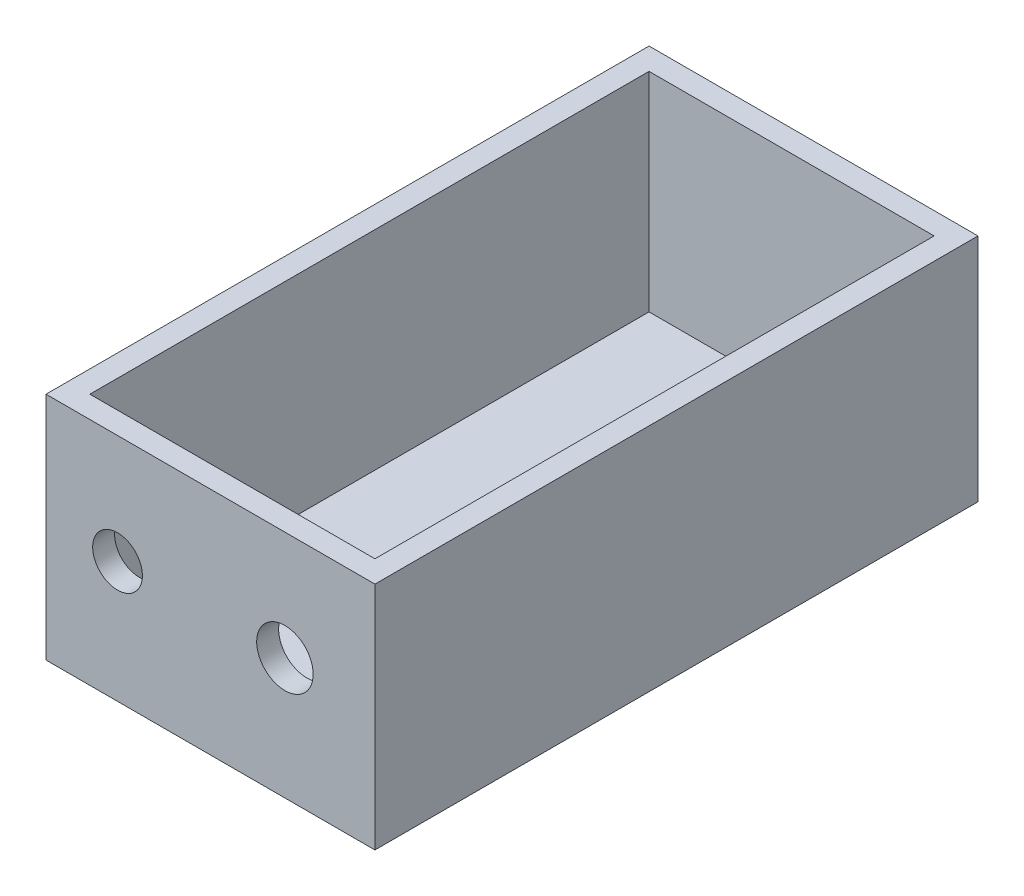
ISO-10303-21;
HEADER;
FILE_DESCRIPTION(('STEP AP214'),'2;1');
FILE_NAME('part.step','',(''),(''),'','','');
FILE_SCHEMA(('AUTOMOTIVE_DESIGN { 1 0 10303 214 1 1 1 1 }'));
ENDSEC;
DATA;
#1=APPLICATION_CONTEXT('core data for automotive mechanical design processes');
#2=APPLICATION_PROTOCOL_DEFINITION('international standard','automotive_design',2000,#1);
#3=PRODUCT_CONTEXT('',#1,'mechanical');
#4=PRODUCT('Part','Part','',(#3));
#5=PRODUCT_RELATED_PRODUCT_CATEGORY('part','',(#4));
#6=PRODUCT_DEFINITION_FORMATION('','',#4);
#7=PRODUCT_DEFINITION_CONTEXT('part definition',#1,'design');
#8=PRODUCT_DEFINITION('design','',#6,#7);
#9=PRODUCT_DEFINITION_SHAPE('','',#8);
#10=(LENGTH_UNIT() NAMED_UNIT(*) SI_UNIT(.MILLI.,.METRE.));
#11=(NAMED_UNIT(*) PLANE_ANGLE_UNIT() SI_UNIT($,.RADIAN.));
#12=(NAMED_UNIT(*) SI_UNIT($,.STERADIAN.) SOLID_ANGLE_UNIT());
#13=UNCERTAINTY_MEASURE_WITH_UNIT(LENGTH_MEASURE(1.E-05),#10,'distance_accuracy_value','');
#14=(GEOMETRIC_REPRESENTATION_CONTEXT(3) GLOBAL_UNCERTAINTY_ASSIGNED_CONTEXT((#13)) GLOBAL_UNIT_ASSIGNED_CONTEXT((#10,
#11,#12)) REPRESENTATION_CONTEXT('',''));
#15=CARTESIAN_POINT('',(0.,0.,0.));
#16=DIRECTION('',(0.,0.,1.));
#17=DIRECTION('',(1.,0.,0.));
#18=AXIS2_PLACEMENT_3D('',#15,#16,#17);
#19=CARTESIAN_POINT('',(0.,21.,0.));
#20=DIRECTION('',(1.,0.,0.));
#21=DIRECTION('',(0.,0.,-1.));
#22=AXIS2_PLACEMENT_3D('',#19,#20,#21);
#23=PLANE('',#22);
#24=DIRECTION('',(0.,0.,1.));
#25=VECTOR('',#24,1.);
#26=CARTESIAN_POINT('',(0.,0.,0.));
#27=LINE('',#26,#25);
#28=CARTESIAN_POINT('',(0.,0.,-55.));
#29=VERTEX_POINT('',#28);
#30=CARTESIAN_POINT('',(0.,0.,0.));
#31=VERTEX_POINT('',#30);
#32=EDGE_CURVE('E163',#29,#31,#27,.T.);
#33=ORIENTED_EDGE('',*,*,#32,.T.);
#34=DIRECTION('',(0.,-1.,0.));
#35=VECTOR('',#34,1.);
#36=CARTESIAN_POINT('',(0.,21.,0.));
#37=LINE('',#36,#35);
#38=CARTESIAN_POINT('',(0.,21.,0.));
#39=VERTEX_POINT('',#38);
#40=EDGE_CURVE('E11',#39,#31,#37,.T.);
#41=ORIENTED_EDGE('',*,*,#40,.F.);
#42=DIRECTION('',(0.,0.,1.));
#43=VECTOR('',#42,1.);
#44=CARTESIAN_POINT('',(0.,21.,0.));
#45=LINE('',#44,#43);
#46=CARTESIAN_POINT('',(0.,21.,-55.));
#47=VERTEX_POINT('',#46);
#48=EDGE_CURVE('E169',#47,#39,#45,.T.);
#49=ORIENTED_EDGE('',*,*,#48,.F.);
#50=DIRECTION('',(0.,-1.,0.));
#51=VECTOR('',#50,1.);
#52=CARTESIAN_POINT('',(0.,21.,-55.));
#53=LINE('',#52,#51);
#54=EDGE_CURVE('E179',#47,#29,#53,.T.);
#55=ORIENTED_EDGE('',*,*,#54,.T.);
#56=EDGE_LOOP('',(#33,#41,#49,#55));
#57=FACE_BOUND('',#56,.T.);
#58=ADVANCED_FACE('F39',(#57),#23,.F.);
#59=CARTESIAN_POINT('',(0.,21.,0.));
#60=DIRECTION('',(0.,0.,-1.));
#61=DIRECTION('',(-1.,0.,0.));
#62=AXIS2_PLACEMENT_3D('',#59,#60,#61);
#63=PLANE('',#62);
#64=CARTESIAN_POINT('',(6.52409258425673,11.0547059827059,0.));
#65=DIRECTION('',(0.,0.,1.));
#66=DIRECTION('',(1.,0.,0.));
#67=AXIS2_PLACEMENT_3D('',#64,#65,#66);
#68=CIRCLE('',#67,2.26711259975675);
#69=CARTESIAN_POINT('',(8.79120518401348,11.0547059827059,0.));
#70=VERTEX_POINT('',#69);
#71=EDGE_CURVE('E201',#70,#70,#68,.T.);
#72=ORIENTED_EDGE('',*,*,#71,.F.);
#73=EDGE_LOOP('',(#72));
#74=FACE_BOUND('',#73,.T.);
#75=CARTESIAN_POINT('',(21.7896012283179,11.0547059827059,0.));
#76=DIRECTION('',(0.,0.,1.));
#77=DIRECTION('',(1.,0.,0.));
#78=AXIS2_PLACEMENT_3D('',#75,#76,#77);
#79=CIRCLE('',#78,2.5738357597545);
#80=CARTESIAN_POINT('',(24.3634369880724,11.0547059827059,0.));
#81=VERTEX_POINT('',#80);
#82=EDGE_CURVE('E145',#81,#81,#79,.T.);
#83=ORIENTED_EDGE('',*,*,#82,.F.);
#84=EDGE_LOOP('',(#83));
#85=FACE_BOUND('',#84,.T.);
#86=DIRECTION('',(1.,0.,0.));
#87=VECTOR('',#86,1.);
#88=CARTESIAN_POINT('',(0.,0.,0.));
#89=LINE('',#88,#87);
#90=CARTESIAN_POINT('',(30.,0.,0.));
#91=VERTEX_POINT('',#90);
#92=EDGE_CURVE('E183',#31,#91,#89,.T.);
#93=ORIENTED_EDGE('',*,*,#92,.T.);
#94=DIRECTION('',(0.,-1.,0.));
#95=VECTOR('',#94,1.);
#96=CARTESIAN_POINT('',(30.,21.,0.));
#97=LINE('',#96,#95);
#98=CARTESIAN_POINT('',(30.,21.,0.));
#99=VERTEX_POINT('',#98);
#100=EDGE_CURVE('E48',#99,#91,#97,.T.);
#101=ORIENTED_EDGE('',*,*,#100,.F.);
#102=DIRECTION('',(1.,0.,0.));
#103=VECTOR('',#102,1.);
#104=CARTESIAN_POINT('',(0.,21.,0.));
#105=LINE('',#104,#103);
#106=EDGE_CURVE('E93',#39,#99,#105,.T.);
#107=ORIENTED_EDGE('',*,*,#106,.F.);
#108=ORIENTED_EDGE('',*,*,#40,.T.);
#109=EDGE_LOOP('',(#93,#101,#107,#108));
#110=FACE_BOUND('',#109,.T.);
#111=ADVANCED_FACE('F217',(#74,#85,#110),#63,.F.);
#112=CARTESIAN_POINT('',(30.,21.,0.));
#113=DIRECTION('',(-1.,0.,0.));
#114=DIRECTION('',(0.,0.,1.));
#115=AXIS2_PLACEMENT_3D('',#112,#113,#114);
#116=PLANE('',#115);
#117=DIRECTION('',(0.,0.,-1.));
#118=VECTOR('',#117,1.);
#119=CARTESIAN_POINT('',(30.,0.,0.));
#120=LINE('',#119,#118);
#121=CARTESIAN_POINT('',(30.,0.,-55.));
#122=VERTEX_POINT('',#121);
#123=EDGE_CURVE('E186',#91,#122,#120,.T.);
#124=ORIENTED_EDGE('',*,*,#123,.T.);
#125=DIRECTION('',(0.,-1.,0.));
#126=VECTOR('',#125,1.);
#127=CARTESIAN_POINT('',(30.,21.,-55.));
#128=LINE('',#127,#126);
#129=CARTESIAN_POINT('',(30.,21.,-55.));
#130=VERTEX_POINT('',#129);
#131=EDGE_CURVE('E193',#130,#122,#128,.T.);
#132=ORIENTED_EDGE('',*,*,#131,.F.);
#133=DIRECTION('',(0.,0.,-1.));
#134=VECTOR('',#133,1.);
#135=CARTESIAN_POINT('',(30.,21.,0.));
#136=LINE('',#135,#134);
#137=EDGE_CURVE('E174',#99,#130,#136,.T.);
#138=ORIENTED_EDGE('',*,*,#137,.F.);
#139=ORIENTED_EDGE('',*,*,#100,.T.);
#140=EDGE_LOOP('',(#124,#132,#138,#139));
#141=FACE_BOUND('',#140,.T.);
#142=ADVANCED_FACE('F219',(#141),#116,.F.);
#143=CARTESIAN_POINT('',(0.,21.,-55.));
#144=DIRECTION('',(0.,0.,1.));
#145=DIRECTION('',(1.,0.,0.));
#146=AXIS2_PLACEMENT_3D('',#143,#144,#145);
#147=PLANE('',#146);
#148=DIRECTION('',(-1.,0.,0.));
#149=VECTOR('',#148,1.);
#150=CARTESIAN_POINT('',(0.,0.,-55.));
#151=LINE('',#150,#149);
#152=EDGE_CURVE('E86',#122,#29,#151,.T.);
#153=ORIENTED_EDGE('',*,*,#152,.T.);
#154=ORIENTED_EDGE('',*,*,#54,.F.);
#155=DIRECTION('',(-1.,0.,0.));
#156=VECTOR('',#155,1.);
#157=CARTESIAN_POINT('',(0.,21.,-55.));
#158=LINE('',#157,#156);
#159=EDGE_CURVE('E65',#130,#47,#158,.T.);
#160=ORIENTED_EDGE('',*,*,#159,.F.);
#161=ORIENTED_EDGE('',*,*,#131,.T.);
#162=EDGE_LOOP('',(#153,#154,#160,#161));
#163=FACE_BOUND('',#162,.T.);
#164=ADVANCED_FACE('F231',(#163),#147,.F.);
#165=CARTESIAN_POINT('',(0.,21.,0.));
#166=DIRECTION('',(0.,-1.,0.));
#167=DIRECTION('',(0.,0.,-1.));
#168=AXIS2_PLACEMENT_3D('',#165,#166,#167);
#169=PLANE('',#168);
#170=DIRECTION('',(1.,0.,0.));
#171=VECTOR('',#170,1.);
#172=CARTESIAN_POINT('',(2.,21.,-2.));
#173=LINE('',#172,#171);
#174=CARTESIAN_POINT('',(2.,21.,-2.));
#175=VERTEX_POINT('',#174);
#176=CARTESIAN_POINT('',(28.,21.,-2.));
#177=VERTEX_POINT('',#176);
#178=EDGE_CURVE('E154',#175,#177,#173,.T.);
#179=ORIENTED_EDGE('',*,*,#178,.F.);
#180=DIRECTION('',(0.,0.,1.));
#181=VECTOR('',#180,1.);
#182=CARTESIAN_POINT('',(2.,21.,-53.));
#183=LINE('',#182,#181);
#184=CARTESIAN_POINT('',(2.,21.,-53.));
#185=VERTEX_POINT('',#184);
#186=EDGE_CURVE('E56',#185,#175,#183,.T.);
#187=ORIENTED_EDGE('',*,*,#186,.F.);
#188=DIRECTION('',(-1.,0.,0.));
#189=VECTOR('',#188,1.);
#190=CARTESIAN_POINT('',(28.,21.,-53.));
#191=LINE('',#190,#189);
#192=CARTESIAN_POINT('',(28.,21.,-53.));
#193=VERTEX_POINT('',#192);
#194=EDGE_CURVE('E138',#193,#185,#191,.T.);
#195=ORIENTED_EDGE('',*,*,#194,.F.);
#196=DIRECTION('',(0.,0.,-1.));
#197=VECTOR('',#196,1.);
#198=CARTESIAN_POINT('',(28.,21.,-2.));
#199=LINE('',#198,#197);
#200=EDGE_CURVE('E142',#177,#193,#199,.T.);
#201=ORIENTED_EDGE('',*,*,#200,.F.);
#202=EDGE_LOOP('',(#179,#187,#195,#201));
#203=FACE_BOUND('',#202,.T.);
#204=ORIENTED_EDGE('',*,*,#48,.T.);
#205=ORIENTED_EDGE('',*,*,#106,.T.);
#206=ORIENTED_EDGE('',*,*,#137,.T.);
#207=ORIENTED_EDGE('',*,*,#159,.T.);
#208=EDGE_LOOP('',(#204,#205,#206,#207));
#209=FACE_BOUND('',#208,.T.);
#210=ADVANCED_FACE('F233',(#203,#209),#169,.F.);
#211=CARTESIAN_POINT('',(0.,0.,0.));
#212=DIRECTION('',(0.,-1.,0.));
#213=DIRECTION('',(0.,0.,-1.));
#214=AXIS2_PLACEMENT_3D('',#211,#212,#213);
#215=PLANE('',#214);
#216=ORIENTED_EDGE('',*,*,#32,.F.);
#217=ORIENTED_EDGE('',*,*,#152,.F.);
#218=ORIENTED_EDGE('',*,*,#123,.F.);
#219=ORIENTED_EDGE('',*,*,#92,.F.);
#220=EDGE_LOOP('',(#216,#217,#218,#219));
#221=FACE_BOUND('',#220,.T.);
#222=ADVANCED_FACE('F228',(#221),#215,.T.);
#223=CARTESIAN_POINT('',(2.,2.,-53.));
#224=DIRECTION('',(-1.,0.,0.));
#225=DIRECTION('',(0.,0.,1.));
#226=AXIS2_PLACEMENT_3D('',#223,#224,#225);
#227=PLANE('',#226);
#228=ORIENTED_EDGE('',*,*,#186,.T.);
#229=DIRECTION('',(0.,1.,0.));
#230=VECTOR('',#229,1.);
#231=CARTESIAN_POINT('',(2.,2.,-2.));
#232=LINE('',#231,#230);
#233=CARTESIAN_POINT('',(2.,2.,-2.));
#234=VERTEX_POINT('',#233);
#235=EDGE_CURVE('E113',#234,#175,#232,.T.);
#236=ORIENTED_EDGE('',*,*,#235,.F.);
#237=DIRECTION('',(0.,0.,1.));
#238=VECTOR('',#237,1.);
#239=CARTESIAN_POINT('',(2.,2.,-53.));
#240=LINE('',#239,#238);
#241=CARTESIAN_POINT('',(2.,2.,-53.));
#242=VERTEX_POINT('',#241);
#243=EDGE_CURVE('E117',#242,#234,#240,.T.);
#244=ORIENTED_EDGE('',*,*,#243,.F.);
#245=DIRECTION('',(0.,1.,0.));
#246=VECTOR('',#245,1.);
#247=CARTESIAN_POINT('',(2.,2.,-53.));
#248=LINE('',#247,#246);
#249=EDGE_CURVE('E160',#242,#185,#248,.T.);
#250=ORIENTED_EDGE('',*,*,#249,.T.);
#251=EDGE_LOOP('',(#228,#236,#244,#250));
#252=FACE_BOUND('',#251,.T.);
#253=ADVANCED_FACE('F115',(#252),#227,.F.);
#254=CARTESIAN_POINT('',(28.,2.,-53.));
#255=DIRECTION('',(0.,0.,-1.));
#256=DIRECTION('',(-1.,0.,0.));
#257=AXIS2_PLACEMENT_3D('',#254,#255,#256);
#258=PLANE('',#257);
#259=ORIENTED_EDGE('',*,*,#194,.T.);
#260=ORIENTED_EDGE('',*,*,#249,.F.);
#261=DIRECTION('',(-1.,0.,0.));
#262=VECTOR('',#261,1.);
#263=CARTESIAN_POINT('',(28.,2.,-53.));
#264=LINE('',#263,#262);
#265=CARTESIAN_POINT('',(28.,2.,-53.));
#266=VERTEX_POINT('',#265);
#267=EDGE_CURVE('E124',#266,#242,#264,.T.);
#268=ORIENTED_EDGE('',*,*,#267,.F.);
#269=DIRECTION('',(0.,1.,0.));
#270=VECTOR('',#269,1.);
#271=CARTESIAN_POINT('',(28.,2.,-53.));
#272=LINE('',#271,#270);
#273=EDGE_CURVE('E164',#266,#193,#272,.T.);
#274=ORIENTED_EDGE('',*,*,#273,.T.);
#275=EDGE_LOOP('',(#259,#260,#268,#274));
#276=FACE_BOUND('',#275,.T.);
#277=ADVANCED_FACE('F282',(#276),#258,.F.);
#278=CARTESIAN_POINT('',(28.,2.,-2.));
#279=DIRECTION('',(1.,0.,0.));
#280=DIRECTION('',(0.,0.,-1.));
#281=AXIS2_PLACEMENT_3D('',#278,#279,#280);
#282=PLANE('',#281);
#283=ORIENTED_EDGE('',*,*,#200,.T.);
#284=ORIENTED_EDGE('',*,*,#273,.F.);
#285=DIRECTION('',(0.,0.,-1.));
#286=VECTOR('',#285,1.);
#287=CARTESIAN_POINT('',(28.,2.,-2.));
#288=LINE('',#287,#286);
#289=CARTESIAN_POINT('',(28.,2.,-2.));
#290=VERTEX_POINT('',#289);
#291=EDGE_CURVE('E133',#290,#266,#288,.T.);
#292=ORIENTED_EDGE('',*,*,#291,.F.);
#293=DIRECTION('',(0.,1.,0.));
#294=VECTOR('',#293,1.);
#295=CARTESIAN_POINT('',(28.,2.,-2.));
#296=LINE('',#295,#294);
#297=EDGE_CURVE('E123',#290,#177,#296,.T.);
#298=ORIENTED_EDGE('',*,*,#297,.T.);
#299=EDGE_LOOP('',(#283,#284,#292,#298));
#300=FACE_BOUND('',#299,.T.);
#301=ADVANCED_FACE('F291',(#300),#282,.F.);
#302=CARTESIAN_POINT('',(2.,2.,-2.));
#303=DIRECTION('',(0.,0.,1.));
#304=DIRECTION('',(1.,0.,0.));
#305=AXIS2_PLACEMENT_3D('',#302,#303,#304);
#306=PLANE('',#305);
#307=CARTESIAN_POINT('',(6.52409258425673,11.0547059827059,-2.));
#308=DIRECTION('',(0.,0.,1.));
#309=DIRECTION('',(1.,0.,0.));
#310=AXIS2_PLACEMENT_3D('',#307,#308,#309);
#311=CIRCLE('',#310,2.26711259975675);
#312=CARTESIAN_POINT('',(8.79120518401348,11.0547059827059,-2.));
#313=VERTEX_POINT('',#312);
#314=EDGE_CURVE('E42',#313,#313,#311,.T.);
#315=ORIENTED_EDGE('',*,*,#314,.T.);
#316=EDGE_LOOP('',(#315));
#317=FACE_BOUND('',#316,.T.);
#318=CARTESIAN_POINT('',(21.7896012283179,11.0547059827059,-2.));
#319=DIRECTION('',(0.,0.,1.));
#320=DIRECTION('',(1.,0.,0.));
#321=AXIS2_PLACEMENT_3D('',#318,#319,#320);
#322=CIRCLE('',#321,2.5738357597545);
#323=CARTESIAN_POINT('',(24.3634369880724,11.0547059827059,-2.));
#324=VERTEX_POINT('',#323);
#325=EDGE_CURVE('E198',#324,#324,#322,.T.);
#326=ORIENTED_EDGE('',*,*,#325,.T.);
#327=EDGE_LOOP('',(#326));
#328=FACE_BOUND('',#327,.T.);
#329=ORIENTED_EDGE('',*,*,#178,.T.);
#330=ORIENTED_EDGE('',*,*,#297,.F.);
#331=DIRECTION('',(1.,0.,0.));
#332=VECTOR('',#331,1.);
#333=CARTESIAN_POINT('',(2.,2.,-2.));
#334=LINE('',#333,#332);
#335=EDGE_CURVE('E127',#234,#290,#334,.T.);
#336=ORIENTED_EDGE('',*,*,#335,.F.);
#337=ORIENTED_EDGE('',*,*,#235,.T.);
#338=EDGE_LOOP('',(#329,#330,#336,#337));
#339=FACE_BOUND('',#338,.T.);
#340=ADVANCED_FACE('F128',(#317,#328,#339),#306,.F.);
#341=CARTESIAN_POINT('',(0.,2.,0.));
#342=DIRECTION('',(0.,1.,0.));
#343=DIRECTION('',(0.,0.,1.));
#344=AXIS2_PLACEMENT_3D('',#341,#342,#343);
#345=PLANE('',#344);
#346=ORIENTED_EDGE('',*,*,#243,.T.);
#347=ORIENTED_EDGE('',*,*,#335,.T.);
#348=ORIENTED_EDGE('',*,*,#291,.T.);
#349=ORIENTED_EDGE('',*,*,#267,.T.);
#350=EDGE_LOOP('',(#346,#347,#348,#349));
#351=FACE_BOUND('',#350,.T.);
#352=ADVANCED_FACE('F135',(#351),#345,.T.);
#353=CARTESIAN_POINT('',(21.7896012283179,11.0547059827059,-3.));
#354=DIRECTION('',(0.,0.,1.));
#355=DIRECTION('',(1.,0.,0.));
#356=AXIS2_PLACEMENT_3D('',#353,#354,#355);
#357=CYLINDRICAL_SURFACE('',#356,2.5738357597545);
#358=ORIENTED_EDGE('',*,*,#82,.T.);
#359=EDGE_LOOP('',(#358));
#360=FACE_BOUND('',#359,.T.);
#361=ORIENTED_EDGE('',*,*,#325,.F.);
#362=EDGE_LOOP('',(#361));
#363=FACE_BOUND('',#362,.T.);
#364=ADVANCED_FACE('F214',(#360,#363),#357,.F.);
#365=CARTESIAN_POINT('',(6.52409258425673,11.0547059827059,-3.));
#366=DIRECTION('',(0.,0.,1.));
#367=DIRECTION('',(1.,0.,0.));
#368=AXIS2_PLACEMENT_3D('',#365,#366,#367);
#369=CYLINDRICAL_SURFACE('',#368,2.26711259975675);
#370=ORIENTED_EDGE('',*,*,#71,.T.);
#371=EDGE_LOOP('',(#370));
#372=FACE_BOUND('',#371,.T.);
#373=ORIENTED_EDGE('',*,*,#314,.F.);
#374=EDGE_LOOP('',(#373));
#375=FACE_BOUND('',#374,.T.);
#376=ADVANCED_FACE('F320',(#372,#375),#369,.F.);
#377=CLOSED_SHELL('',(#58,#111,#142,#164,#210,#222,#253,#277,#301,#340,#352,#364,#376));
#378=MANIFOLD_SOLID_BREP('B2',#377);
#379=ADVANCED_BREP_SHAPE_REPRESENTATION('',(#18,#378),#14);
#380=SHAPE_DEFINITION_REPRESENTATION(#9,#379);
ENDSEC;
END-ISO-10303-21;
